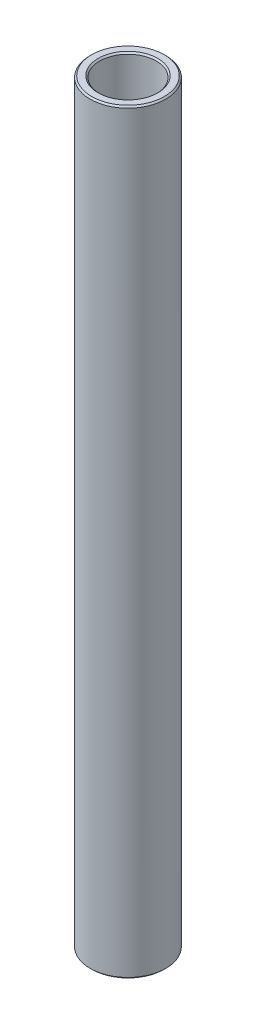
ISO-10303-21;
HEADER;
FILE_DESCRIPTION(('STEP AP214'),'2;1');
FILE_NAME('part.step','',(''),(''),'','','');
FILE_SCHEMA(('AUTOMOTIVE_DESIGN { 1 0 10303 214 1 1 1 1 }'));
ENDSEC;
DATA;
#1=APPLICATION_CONTEXT('core data for automotive mechanical design processes');
#2=APPLICATION_PROTOCOL_DEFINITION('international standard','automotive_design',2000,#1);
#3=PRODUCT_CONTEXT('',#1,'mechanical');
#4=PRODUCT('Part','Part','',(#3));
#5=PRODUCT_RELATED_PRODUCT_CATEGORY('part','',(#4));
#6=PRODUCT_DEFINITION_FORMATION('','',#4);
#7=PRODUCT_DEFINITION_CONTEXT('part definition',#1,'design');
#8=PRODUCT_DEFINITION('design','',#6,#7);
#9=PRODUCT_DEFINITION_SHAPE('','',#8);
#10=(LENGTH_UNIT() NAMED_UNIT(*) SI_UNIT(.MILLI.,.METRE.));
#11=(NAMED_UNIT(*) PLANE_ANGLE_UNIT() SI_UNIT($,.RADIAN.));
#12=(NAMED_UNIT(*) SI_UNIT($,.STERADIAN.) SOLID_ANGLE_UNIT());
#13=UNCERTAINTY_MEASURE_WITH_UNIT(LENGTH_MEASURE(1.E-05),#10,'distance_accuracy_value','');
#14=(GEOMETRIC_REPRESENTATION_CONTEXT(3) GLOBAL_UNCERTAINTY_ASSIGNED_CONTEXT((#13)) GLOBAL_UNIT_ASSIGNED_CONTEXT((#10,
#11,#12)) REPRESENTATION_CONTEXT('',''));
#15=CARTESIAN_POINT('',(0.,0.,0.));
#16=DIRECTION('',(0.,0.,1.));
#17=DIRECTION('',(1.,0.,0.));
#18=AXIS2_PLACEMENT_3D('',#15,#16,#17);
#19=CARTESIAN_POINT('',(0.,11.60859375,0.));
#20=DIRECTION('',(0.,1.,0.));
#21=DIRECTION('',(-1.,0.,0.));
#22=AXIS2_PLACEMENT_3D('',#19,#20,#21);
#23=CYLINDRICAL_SURFACE('',#22,4.76250000000001);
#24=CARTESIAN_POINT('',(0.,-63.246,0.));
#25=DIRECTION('',(0.,1.,0.));
#26=DIRECTION('',(-1.,0.,0.));
#27=AXIS2_PLACEMENT_3D('',#24,#25,#26);
#28=CIRCLE('',#27,4.76250000000001);
#29=CARTESIAN_POINT('',(-4.76250000000002,-63.246,0.));
#30=VERTEX_POINT('',#29);
#31=EDGE_CURVE('E51',#30,#30,#28,.F.);
#32=ORIENTED_EDGE('',*,*,#31,.T.);
#33=EDGE_LOOP('',(#32));
#34=FACE_BOUND('',#33,.T.);
#35=CARTESIAN_POINT('',(0.,63.246,0.));
#36=DIRECTION('',(0.,-1.,0.));
#37=DIRECTION('',(1.,0.,0.));
#38=AXIS2_PLACEMENT_3D('',#35,#36,#37);
#39=CIRCLE('',#38,4.76250000000001);
#40=CARTESIAN_POINT('',(4.76250000000002,63.246,0.));
#41=VERTEX_POINT('',#40);
#42=EDGE_CURVE('E54',#41,#41,#39,.F.);
#43=ORIENTED_EDGE('',*,*,#42,.T.);
#44=EDGE_LOOP('',(#43));
#45=FACE_BOUND('',#44,.T.);
#46=ADVANCED_FACE('F31',(#34,#45),#23,.F.);
#47=CARTESIAN_POINT('',(4.76250000000001,63.5,0.));
#48=DIRECTION('',(0.,-1.,0.));
#49=DIRECTION('',(1.,0.,0.));
#50=AXIS2_PLACEMENT_3D('',#47,#48,#49);
#51=PLANE('',#50);
#52=CARTESIAN_POINT('',(0.,63.5,0.));
#53=DIRECTION('',(0.,-1.,0.));
#54=DIRECTION('',(1.,0.,0.));
#55=AXIS2_PLACEMENT_3D('',#52,#53,#54);
#56=CIRCLE('',#55,6.09599999999997);
#57=CARTESIAN_POINT('',(6.09599999999998,63.5,0.));
#58=VERTEX_POINT('',#57);
#59=EDGE_CURVE('E10',#58,#58,#56,.F.);
#60=ORIENTED_EDGE('',*,*,#59,.T.);
#61=EDGE_LOOP('',(#60));
#62=FACE_BOUND('',#61,.T.);
#63=CARTESIAN_POINT('',(0.,63.5,0.));
#64=DIRECTION('',(0.,-1.,0.));
#65=DIRECTION('',(1.,0.,0.));
#66=AXIS2_PLACEMENT_3D('',#63,#64,#65);
#67=CIRCLE('',#66,5.01650000000003);
#68=CARTESIAN_POINT('',(5.01650000000004,63.5,0.));
#69=VERTEX_POINT('',#68);
#70=EDGE_CURVE('E38',#69,#69,#67,.T.);
#71=ORIENTED_EDGE('',*,*,#70,.T.);
#72=EDGE_LOOP('',(#71));
#73=FACE_BOUND('',#72,.T.);
#74=ADVANCED_FACE('F77',(#62,#73),#51,.F.);
#75=CARTESIAN_POINT('',(0.,11.60859375,0.));
#76=DIRECTION('',(0.,1.,0.));
#77=DIRECTION('',(-1.,0.,0.));
#78=AXIS2_PLACEMENT_3D('',#75,#76,#77);
#79=CYLINDRICAL_SURFACE('',#78,6.35);
#80=CARTESIAN_POINT('',(0.,-63.246,0.));
#81=DIRECTION('',(0.,1.,0.));
#82=DIRECTION('',(-1.,0.,0.));
#83=AXIS2_PLACEMENT_3D('',#80,#81,#82);
#84=CIRCLE('',#83,6.35);
#85=CARTESIAN_POINT('',(-6.35,-63.246,0.));
#86=VERTEX_POINT('',#85);
#87=EDGE_CURVE('E42',#86,#86,#84,.T.);
#88=ORIENTED_EDGE('',*,*,#87,.T.);
#89=EDGE_LOOP('',(#88));
#90=FACE_BOUND('',#89,.T.);
#91=CARTESIAN_POINT('',(0.,63.246,0.));
#92=DIRECTION('',(0.,-1.,0.));
#93=DIRECTION('',(1.,0.,0.));
#94=AXIS2_PLACEMENT_3D('',#91,#92,#93);
#95=CIRCLE('',#94,6.35);
#96=CARTESIAN_POINT('',(6.35000000000001,63.246,0.));
#97=VERTEX_POINT('',#96);
#98=EDGE_CURVE('E46',#97,#97,#95,.T.);
#99=ORIENTED_EDGE('',*,*,#98,.T.);
#100=EDGE_LOOP('',(#99));
#101=FACE_BOUND('',#100,.T.);
#102=ADVANCED_FACE('F74',(#90,#101),#79,.T.);
#103=CARTESIAN_POINT('',(6.35000000000001,-63.5,0.));
#104=DIRECTION('',(0.,1.,0.));
#105=DIRECTION('',(-1.,0.,0.));
#106=AXIS2_PLACEMENT_3D('',#103,#104,#105);
#107=PLANE('',#106);
#108=CARTESIAN_POINT('',(0.,-63.5,0.));
#109=DIRECTION('',(0.,1.,0.));
#110=DIRECTION('',(-1.,0.,0.));
#111=AXIS2_PLACEMENT_3D('',#108,#109,#110);
#112=CIRCLE('',#111,5.01650000000002);
#113=CARTESIAN_POINT('',(-5.01650000000003,-63.5,0.));
#114=VERTEX_POINT('',#113);
#115=EDGE_CURVE('E57',#114,#114,#112,.T.);
#116=ORIENTED_EDGE('',*,*,#115,.T.);
#117=EDGE_LOOP('',(#116));
#118=FACE_BOUND('',#117,.T.);
#119=CARTESIAN_POINT('',(0.,-63.5,0.));
#120=DIRECTION('',(0.,1.,0.));
#121=DIRECTION('',(-1.,0.,0.));
#122=AXIS2_PLACEMENT_3D('',#119,#120,#121);
#123=CIRCLE('',#122,6.09599999999998);
#124=CARTESIAN_POINT('',(-6.09599999999998,-63.5,0.));
#125=VERTEX_POINT('',#124);
#126=EDGE_CURVE('E60',#125,#125,#123,.F.);
#127=ORIENTED_EDGE('',*,*,#126,.T.);
#128=EDGE_LOOP('',(#127));
#129=FACE_BOUND('',#128,.T.);
#130=ADVANCED_FACE('F64',(#118,#129),#107,.F.);
#131=CARTESIAN_POINT('',(0.,-63.5,0.));
#132=DIRECTION('',(0.,-1.,0.));
#133=DIRECTION('',(1.,0.,0.));
#134=AXIS2_PLACEMENT_3D('',#131,#132,#133);
#135=CONICAL_SURFACE('',#134,5.01650000000002,0.785398163397457);
#136=ORIENTED_EDGE('',*,*,#31,.F.);
#137=EDGE_LOOP('',(#136));
#138=FACE_BOUND('',#137,.T.);
#139=ORIENTED_EDGE('',*,*,#115,.F.);
#140=EDGE_LOOP('',(#139));
#141=FACE_BOUND('',#140,.T.);
#142=ADVANCED_FACE('F70',(#138,#141),#135,.F.);
#143=CARTESIAN_POINT('',(0.,-63.246,0.));
#144=DIRECTION('',(0.,1.,0.));
#145=DIRECTION('',(-1.,0.,0.));
#146=AXIS2_PLACEMENT_3D('',#143,#144,#145);
#147=CONICAL_SURFACE('',#146,6.35,0.785398163397431);
#148=ORIENTED_EDGE('',*,*,#126,.F.);
#149=EDGE_LOOP('',(#148));
#150=FACE_BOUND('',#149,.T.);
#151=ORIENTED_EDGE('',*,*,#87,.F.);
#152=EDGE_LOOP('',(#151));
#153=FACE_BOUND('',#152,.T.);
#154=ADVANCED_FACE('F66',(#150,#153),#147,.T.);
#155=CARTESIAN_POINT('',(0.,63.5,0.));
#156=DIRECTION('',(0.,-1.,0.));
#157=DIRECTION('',(1.,0.,0.));
#158=AXIS2_PLACEMENT_3D('',#155,#156,#157);
#159=CONICAL_SURFACE('',#158,6.09599999999998,0.785398163397458);
#160=ORIENTED_EDGE('',*,*,#98,.F.);
#161=EDGE_LOOP('',(#160));
#162=FACE_BOUND('',#161,.T.);
#163=ORIENTED_EDGE('',*,*,#59,.F.);
#164=EDGE_LOOP('',(#163));
#165=FACE_BOUND('',#164,.T.);
#166=ADVANCED_FACE('F69',(#162,#165),#159,.T.);
#167=CARTESIAN_POINT('',(0.,63.246,0.));
#168=DIRECTION('',(0.,1.,0.));
#169=DIRECTION('',(-1.,0.,0.));
#170=AXIS2_PLACEMENT_3D('',#167,#168,#169);
#171=CONICAL_SURFACE('',#170,4.76250000000001,0.785398163397484);
#172=ORIENTED_EDGE('',*,*,#70,.F.);
#173=EDGE_LOOP('',(#172));
#174=FACE_BOUND('',#173,.T.);
#175=ORIENTED_EDGE('',*,*,#42,.F.);
#176=EDGE_LOOP('',(#175));
#177=FACE_BOUND('',#176,.T.);
#178=ADVANCED_FACE('F33',(#174,#177),#171,.F.);
#179=CLOSED_SHELL('',(#46,#74,#102,#130,#142,#154,#166,#178));
#180=MANIFOLD_SOLID_BREP('B2',#179);
#181=ADVANCED_BREP_SHAPE_REPRESENTATION('',(#18,#180),#14);
#182=SHAPE_DEFINITION_REPRESENTATION(#9,#181);
ENDSEC;
END-ISO-10303-21;
